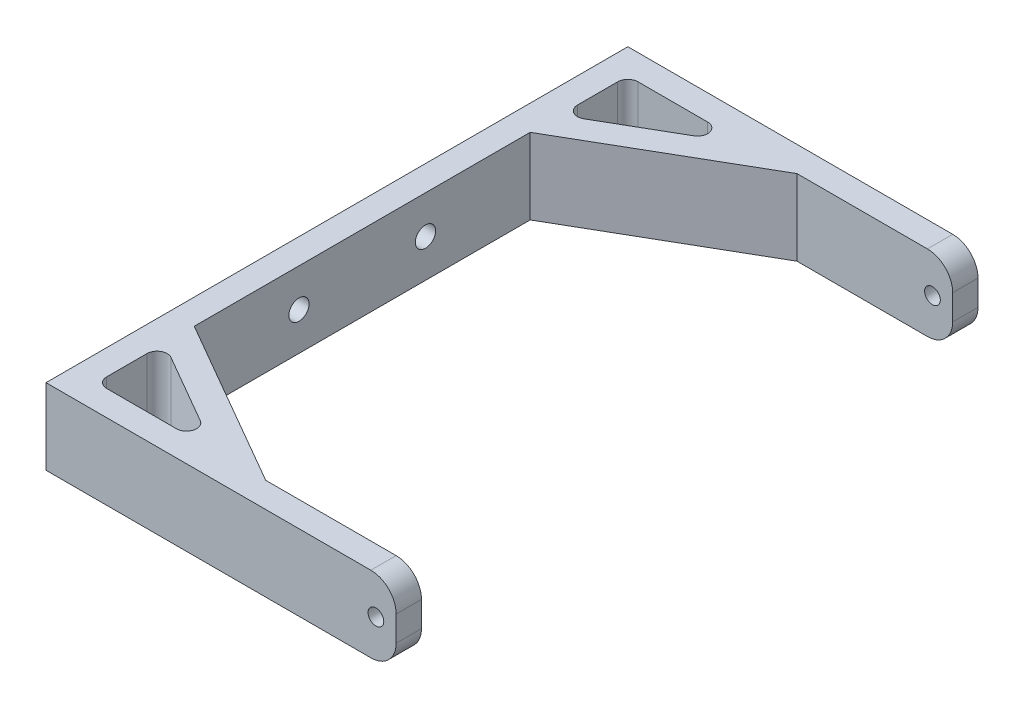
ISO-10303-21;
HEADER;
FILE_DESCRIPTION(('STEP AP214'),'2;1');
FILE_NAME('part.step','',(''),(''),'','','');
FILE_SCHEMA(('AUTOMOTIVE_DESIGN { 1 0 10303 214 1 1 1 1 }'));
ENDSEC;
DATA;
#1=APPLICATION_CONTEXT('core data for automotive mechanical design processes');
#2=APPLICATION_PROTOCOL_DEFINITION('international standard','automotive_design',2000,#1);
#3=PRODUCT_CONTEXT('',#1,'mechanical');
#4=PRODUCT('Part','Part','',(#3));
#5=PRODUCT_RELATED_PRODUCT_CATEGORY('part','',(#4));
#6=PRODUCT_DEFINITION_FORMATION('','',#4);
#7=PRODUCT_DEFINITION_CONTEXT('part definition',#1,'design');
#8=PRODUCT_DEFINITION('design','',#6,#7);
#9=PRODUCT_DEFINITION_SHAPE('','',#8);
#10=(LENGTH_UNIT() NAMED_UNIT(*) SI_UNIT(.MILLI.,.METRE.));
#11=(NAMED_UNIT(*) PLANE_ANGLE_UNIT() SI_UNIT($,.RADIAN.));
#12=(NAMED_UNIT(*) SI_UNIT($,.STERADIAN.) SOLID_ANGLE_UNIT());
#13=UNCERTAINTY_MEASURE_WITH_UNIT(LENGTH_MEASURE(1.E-05),#10,'distance_accuracy_value','');
#14=(GEOMETRIC_REPRESENTATION_CONTEXT(3) GLOBAL_UNCERTAINTY_ASSIGNED_CONTEXT((#13)) GLOBAL_UNIT_ASSIGNED_CONTEXT((#10,
#11,#12)) REPRESENTATION_CONTEXT('',''));
#15=CARTESIAN_POINT('',(0.,0.,0.));
#16=DIRECTION('',(0.,0.,1.));
#17=DIRECTION('',(1.,0.,0.));
#18=AXIS2_PLACEMENT_3D('',#15,#16,#17);
#19=CARTESIAN_POINT('',(0.,15.,0.));
#20=DIRECTION('',(0.,-1.,0.));
#21=DIRECTION('',(0.,0.,-1.));
#22=AXIS2_PLACEMENT_3D('',#19,#20,#21);
#23=PLANE('',#22);
#24=DIRECTION('',(-1.,0.,0.));
#25=VECTOR('',#24,1.);
#26=CARTESIAN_POINT('',(25.7342905835962,15.,-52.5));
#27=LINE('',#26,#25);
#28=CARTESIAN_POINT('',(18.2701889684584,15.,-52.5));
#29=VERTEX_POINT('',#28);
#30=CARTESIAN_POINT('',(4.5,15.,-52.5));
#31=VERTEX_POINT('',#30);
#32=EDGE_CURVE('E527',#29,#31,#27,.T.);
#33=ORIENTED_EDGE('',*,*,#32,.F.);
#34=CARTESIAN_POINT('',(18.2701889684584,15.,-50.5));
#35=DIRECTION('',(0.,-1.,0.));
#36=DIRECTION('',(0.,0.,-1.));
#37=AXIS2_PLACEMENT_3D('',#34,#35,#36);
#38=CIRCLE('',#37,2.);
#39=CARTESIAN_POINT('',(19.2701889684584,15.,-48.7679491924311));
#40=VERTEX_POINT('',#39);
#41=EDGE_CURVE('E283',#29,#40,#38,.T.);
#42=ORIENTED_EDGE('',*,*,#41,.T.);
#43=DIRECTION('',(0.866025403784441,0.,-0.499999999999995));
#44=VECTOR('',#43,1.);
#45=CARTESIAN_POINT('',(2.50000000000001,15.,-39.0856760771309));
#46=LINE('',#45,#44);
#47=CARTESIAN_POINT('',(5.5,15.,-40.8177268846997));
#48=VERTEX_POINT('',#47);
#49=EDGE_CURVE('E368',#48,#40,#46,.T.);
#50=ORIENTED_EDGE('',*,*,#49,.F.);
#51=CARTESIAN_POINT('',(4.5,15.,-42.5497776922686));
#52=DIRECTION('',(0.,-1.,0.));
#53=DIRECTION('',(0.,0.,-1.));
#54=AXIS2_PLACEMENT_3D('',#51,#52,#53);
#55=CIRCLE('',#54,2.);
#56=CARTESIAN_POINT('',(2.5,15.,-42.5497776922686));
#57=VERTEX_POINT('',#56);
#58=EDGE_CURVE('E279',#48,#57,#55,.T.);
#59=ORIENTED_EDGE('',*,*,#58,.T.);
#60=DIRECTION('',(0.,0.,1.));
#61=VECTOR('',#60,1.);
#62=CARTESIAN_POINT('',(2.5,15.,-52.5));
#63=LINE('',#62,#61);
#64=CARTESIAN_POINT('',(2.5,15.,-50.5));
#65=VERTEX_POINT('',#64);
#66=EDGE_CURVE('E530',#65,#57,#63,.T.);
#67=ORIENTED_EDGE('',*,*,#66,.F.);
#68=CARTESIAN_POINT('',(4.5,15.,-50.5));
#69=DIRECTION('',(0.,-1.,0.));
#70=DIRECTION('',(0.,0.,-1.));
#71=AXIS2_PLACEMENT_3D('',#68,#69,#70);
#72=CIRCLE('',#71,2.);
#73=EDGE_CURVE('E287',#65,#31,#72,.T.);
#74=ORIENTED_EDGE('',*,*,#73,.T.);
#75=EDGE_LOOP('',(#33,#42,#50,#59,#67,#74));
#76=FACE_BOUND('',#75,.T.);
#77=DIRECTION('',(1.,0.,0.));
#78=VECTOR('',#77,1.);
#79=CARTESIAN_POINT('',(34.9278302695179,15.,57.5));
#80=LINE('',#79,#78);
#81=CARTESIAN_POINT('',(-2.5,15.,57.5));
#82=VERTEX_POINT('',#81);
#83=CARTESIAN_POINT('',(61.7079178543789,15.,57.5));
#84=VERTEX_POINT('',#83);
#85=EDGE_CURVE('E357',#82,#84,#80,.T.);
#86=ORIENTED_EDGE('',*,*,#85,.T.);
#87=DIRECTION('',(0.,0.,-1.));
#88=VECTOR('',#87,1.);
#89=CARTESIAN_POINT('',(61.7079178543789,15.,0.));
#90=LINE('',#89,#88);
#91=CARTESIAN_POINT('',(61.7079178543789,15.,52.5));
#92=VERTEX_POINT('',#91);
#93=EDGE_CURVE('E320',#84,#92,#90,.T.);
#94=ORIENTED_EDGE('',*,*,#93,.T.);
#95=DIRECTION('',(-1.,0.,0.));
#96=VECTOR('',#95,1.);
#97=CARTESIAN_POINT('',(61.7079178543789,15.,52.5));
#98=LINE('',#97,#96);
#99=CARTESIAN_POINT('',(35.930443006303,15.,52.5));
#100=VERTEX_POINT('',#99);
#101=EDGE_CURVE('E361',#92,#100,#98,.T.);
#102=ORIENTED_EDGE('',*,*,#101,.T.);
#103=DIRECTION('',(-0.866025403784441,0.,-0.499999999999995));
#104=VECTOR('',#103,1.);
#105=CARTESIAN_POINT('',(35.930443006303,15.,52.5));
#106=LINE('',#105,#104);
#107=CARTESIAN_POINT('',(2.5,15.,33.1989247311828));
#108=VERTEX_POINT('',#107);
#109=EDGE_CURVE('E363',#100,#108,#106,.T.);
#110=ORIENTED_EDGE('',*,*,#109,.T.);
#111=DIRECTION('',(0.,0.,-1.));
#112=VECTOR('',#111,1.);
#113=CARTESIAN_POINT('',(2.5,15.,33.1989247311828));
#114=LINE('',#113,#112);
#115=CARTESIAN_POINT('',(2.5,15.,-33.1989247311828));
#116=VERTEX_POINT('',#115);
#117=EDGE_CURVE('E227',#108,#116,#114,.T.);
#118=ORIENTED_EDGE('',*,*,#117,.T.);
#119=DIRECTION('',(0.866025403784441,0.,-0.499999999999995));
#120=VECTOR('',#119,1.);
#121=CARTESIAN_POINT('',(35.930443006303,15.,-52.5));
#122=LINE('',#121,#120);
#123=CARTESIAN_POINT('',(35.930443006303,15.,-52.5));
#124=VERTEX_POINT('',#123);
#125=EDGE_CURVE('E221',#116,#124,#122,.T.);
#126=ORIENTED_EDGE('',*,*,#125,.T.);
#127=DIRECTION('',(1.,0.,0.));
#128=VECTOR('',#127,1.);
#129=CARTESIAN_POINT('',(61.7079178543789,15.,-52.5));
#130=LINE('',#129,#128);
#131=CARTESIAN_POINT('',(61.7079178543789,15.,-52.5));
#132=VERTEX_POINT('',#131);
#133=EDGE_CURVE('E210',#124,#132,#130,.T.);
#134=ORIENTED_EDGE('',*,*,#133,.T.);
#135=DIRECTION('',(0.,0.,-1.));
#136=VECTOR('',#135,1.);
#137=CARTESIAN_POINT('',(61.7079178543789,15.,0.));
#138=LINE('',#137,#136);
#139=CARTESIAN_POINT('',(61.7079178543789,15.,-57.5));
#140=VERTEX_POINT('',#139);
#141=EDGE_CURVE('E318',#132,#140,#138,.T.);
#142=ORIENTED_EDGE('',*,*,#141,.T.);
#143=DIRECTION('',(-1.,0.,0.));
#144=VECTOR('',#143,1.);
#145=CARTESIAN_POINT('',(66.7079178543789,15.,-57.5));
#146=LINE('',#145,#144);
#147=CARTESIAN_POINT('',(-2.5,15.,-57.5));
#148=VERTEX_POINT('',#147);
#149=EDGE_CURVE('E220',#140,#148,#146,.T.);
#150=ORIENTED_EDGE('',*,*,#149,.T.);
#151=DIRECTION('',(0.,0.,1.));
#152=VECTOR('',#151,1.);
#153=CARTESIAN_POINT('',(-2.5,15.,-57.5));
#154=LINE('',#153,#152);
#155=EDGE_CURVE('E355',#148,#82,#154,.T.);
#156=ORIENTED_EDGE('',*,*,#155,.T.);
#157=EDGE_LOOP('',(#86,#94,#102,#110,#118,#126,#134,#142,#150,#156));
#158=FACE_BOUND('',#157,.T.);
#159=DIRECTION('',(1.,0.,0.));
#160=VECTOR('',#159,1.);
#161=CARTESIAN_POINT('',(25.7342905835962,15.,52.5));
#162=LINE('',#161,#160);
#163=CARTESIAN_POINT('',(4.5,15.,52.5));
#164=VERTEX_POINT('',#163);
#165=CARTESIAN_POINT('',(18.2701889684584,15.,52.5));
#166=VERTEX_POINT('',#165);
#167=EDGE_CURVE('E509',#164,#166,#162,.T.);
#168=ORIENTED_EDGE('',*,*,#167,.F.);
#169=CARTESIAN_POINT('',(4.5,15.,50.5));
#170=DIRECTION('',(0.,-1.,0.));
#171=DIRECTION('',(0.,0.,-1.));
#172=AXIS2_PLACEMENT_3D('',#169,#170,#171);
#173=CIRCLE('',#172,2.);
#174=CARTESIAN_POINT('',(2.5,15.,50.5));
#175=VERTEX_POINT('',#174);
#176=EDGE_CURVE('E295',#164,#175,#173,.T.);
#177=ORIENTED_EDGE('',*,*,#176,.T.);
#178=DIRECTION('',(0.,0.,1.));
#179=VECTOR('',#178,1.);
#180=CARTESIAN_POINT('',(2.5,15.,52.5));
#181=LINE('',#180,#179);
#182=CARTESIAN_POINT('',(2.5,15.,42.5497776922686));
#183=VERTEX_POINT('',#182);
#184=EDGE_CURVE('E516',#183,#175,#181,.T.);
#185=ORIENTED_EDGE('',*,*,#184,.F.);
#186=CARTESIAN_POINT('',(4.5,15.,42.5497776922686));
#187=DIRECTION('',(0.,-1.,0.));
#188=DIRECTION('',(0.,0.,-1.));
#189=AXIS2_PLACEMENT_3D('',#186,#187,#188);
#190=CIRCLE('',#189,2.);
#191=CARTESIAN_POINT('',(5.49999999999999,15.,40.8177268846997));
#192=VERTEX_POINT('',#191);
#193=EDGE_CURVE('E299',#183,#192,#190,.T.);
#194=ORIENTED_EDGE('',*,*,#193,.T.);
#195=DIRECTION('',(-0.866025403784441,0.,-0.499999999999995));
#196=VECTOR('',#195,1.);
#197=CARTESIAN_POINT('',(2.5,15.,39.0856760771309));
#198=LINE('',#197,#196);
#199=CARTESIAN_POINT('',(19.2701889684584,15.,48.7679491924311));
#200=VERTEX_POINT('',#199);
#201=EDGE_CURVE('E512',#200,#192,#198,.T.);
#202=ORIENTED_EDGE('',*,*,#201,.F.);
#203=CARTESIAN_POINT('',(18.2701889684584,15.,50.5));
#204=DIRECTION('',(0.,-1.,0.));
#205=DIRECTION('',(0.,0.,-1.));
#206=AXIS2_PLACEMENT_3D('',#203,#204,#205);
#207=CIRCLE('',#206,2.);
#208=EDGE_CURVE('E291',#200,#166,#207,.T.);
#209=ORIENTED_EDGE('',*,*,#208,.T.);
#210=EDGE_LOOP('',(#168,#177,#185,#194,#202,#209));
#211=FACE_BOUND('',#210,.T.);
#212=ADVANCED_FACE('F38',(#76,#158,#211),#23,.F.);
#213=CARTESIAN_POINT('',(0.,0.,0.));
#214=DIRECTION('',(0.,-1.,0.));
#215=DIRECTION('',(0.,0.,-1.));
#216=AXIS2_PLACEMENT_3D('',#213,#214,#215);
#217=PLANE('',#216);
#218=DIRECTION('',(-1.,0.,0.));
#219=VECTOR('',#218,1.);
#220=CARTESIAN_POINT('',(61.7079178543789,0.,52.5));
#221=LINE('',#220,#219);
#222=CARTESIAN_POINT('',(61.7079178543789,0.,52.5));
#223=VERTEX_POINT('',#222);
#224=CARTESIAN_POINT('',(35.930443006303,0.,52.5));
#225=VERTEX_POINT('',#224);
#226=EDGE_CURVE('E374',#223,#225,#221,.T.);
#227=ORIENTED_EDGE('',*,*,#226,.F.);
#228=DIRECTION('',(0.,0.,-1.));
#229=VECTOR('',#228,1.);
#230=CARTESIAN_POINT('',(61.7079178543789,0.,57.5));
#231=LINE('',#230,#229);
#232=CARTESIAN_POINT('',(61.7079178543789,0.,57.5));
#233=VERTEX_POINT('',#232);
#234=EDGE_CURVE('E312',#223,#233,#231,.F.);
#235=ORIENTED_EDGE('',*,*,#234,.T.);
#236=DIRECTION('',(1.,0.,0.));
#237=VECTOR('',#236,1.);
#238=CARTESIAN_POINT('',(66.7079178543789,0.,57.5));
#239=LINE('',#238,#237);
#240=CARTESIAN_POINT('',(-2.5,0.,57.5));
#241=VERTEX_POINT('',#240);
#242=EDGE_CURVE('E371',#241,#233,#239,.T.);
#243=ORIENTED_EDGE('',*,*,#242,.F.);
#244=DIRECTION('',(0.,0.,1.));
#245=VECTOR('',#244,1.);
#246=CARTESIAN_POINT('',(-2.5,0.,57.5));
#247=LINE('',#246,#245);
#248=CARTESIAN_POINT('',(-2.5,0.,-57.5));
#249=VERTEX_POINT('',#248);
#250=EDGE_CURVE('E345',#249,#241,#247,.T.);
#251=ORIENTED_EDGE('',*,*,#250,.F.);
#252=DIRECTION('',(-1.,0.,0.));
#253=VECTOR('',#252,1.);
#254=CARTESIAN_POINT('',(34.9278302695179,0.,-57.5));
#255=LINE('',#254,#253);
#256=CARTESIAN_POINT('',(61.7079178543789,0.,-57.5));
#257=VERTEX_POINT('',#256);
#258=EDGE_CURVE('E335',#257,#249,#255,.T.);
#259=ORIENTED_EDGE('',*,*,#258,.F.);
#260=DIRECTION('',(0.,0.,-1.));
#261=VECTOR('',#260,1.);
#262=CARTESIAN_POINT('',(61.7079178543789,0.,-52.5));
#263=LINE('',#262,#261);
#264=CARTESIAN_POINT('',(61.7079178543789,0.,-52.5));
#265=VERTEX_POINT('',#264);
#266=EDGE_CURVE('E310',#257,#265,#263,.F.);
#267=ORIENTED_EDGE('',*,*,#266,.T.);
#268=DIRECTION('',(1.,0.,0.));
#269=VECTOR('',#268,1.);
#270=CARTESIAN_POINT('',(61.7079178543789,0.,-52.5));
#271=LINE('',#270,#269);
#272=CARTESIAN_POINT('',(35.930443006303,0.,-52.5));
#273=VERTEX_POINT('',#272);
#274=EDGE_CURVE('E347',#273,#265,#271,.T.);
#275=ORIENTED_EDGE('',*,*,#274,.F.);
#276=DIRECTION('',(0.866025403784441,0.,-0.499999999999995));
#277=VECTOR('',#276,1.);
#278=CARTESIAN_POINT('',(35.930443006303,0.,-52.5));
#279=LINE('',#278,#277);
#280=CARTESIAN_POINT('',(2.5,0.,-33.1989247311828));
#281=VERTEX_POINT('',#280);
#282=EDGE_CURVE('E235',#281,#273,#279,.T.);
#283=ORIENTED_EDGE('',*,*,#282,.F.);
#284=DIRECTION('',(0.,0.,-1.));
#285=VECTOR('',#284,1.);
#286=CARTESIAN_POINT('',(2.5,0.,33.1989247311828));
#287=LINE('',#286,#285);
#288=CARTESIAN_POINT('',(2.5,0.,33.1989247311828));
#289=VERTEX_POINT('',#288);
#290=EDGE_CURVE('E231',#289,#281,#287,.T.);
#291=ORIENTED_EDGE('',*,*,#290,.F.);
#292=DIRECTION('',(-0.866025403784441,0.,-0.499999999999995));
#293=VECTOR('',#292,1.);
#294=CARTESIAN_POINT('',(35.930443006303,0.,52.5));
#295=LINE('',#294,#293);
#296=EDGE_CURVE('E376',#225,#289,#295,.T.);
#297=ORIENTED_EDGE('',*,*,#296,.F.);
#298=EDGE_LOOP('',(#227,#235,#243,#251,#259,#267,#275,#283,#291,#297));
#299=FACE_BOUND('',#298,.T.);
#300=DIRECTION('',(0.,0.,1.));
#301=VECTOR('',#300,1.);
#302=CARTESIAN_POINT('',(2.5,0.,-52.5));
#303=LINE('',#302,#301);
#304=CARTESIAN_POINT('',(2.5,0.,-50.5));
#305=VERTEX_POINT('',#304);
#306=CARTESIAN_POINT('',(2.5,0.,-42.5497776922686));
#307=VERTEX_POINT('',#306);
#308=EDGE_CURVE('E538',#305,#307,#303,.T.);
#309=ORIENTED_EDGE('',*,*,#308,.T.);
#310=CARTESIAN_POINT('',(4.5,0.,-42.5497776922686));
#311=DIRECTION('',(0.,-1.,0.));
#312=DIRECTION('',(0.,0.,-1.));
#313=AXIS2_PLACEMENT_3D('',#310,#311,#312);
#314=CIRCLE('',#313,2.);
#315=CARTESIAN_POINT('',(5.5,0.,-40.8177268846997));
#316=VERTEX_POINT('',#315);
#317=EDGE_CURVE('E277',#307,#316,#314,.F.);
#318=ORIENTED_EDGE('',*,*,#317,.T.);
#319=DIRECTION('',(0.866025403784441,0.,-0.499999999999995));
#320=VECTOR('',#319,1.);
#321=CARTESIAN_POINT('',(2.50000000000001,0.,-39.0856760771309));
#322=LINE('',#321,#320);
#323=CARTESIAN_POINT('',(19.2701889684584,0.,-48.7679491924311));
#324=VERTEX_POINT('',#323);
#325=EDGE_CURVE('E531',#316,#324,#322,.T.);
#326=ORIENTED_EDGE('',*,*,#325,.T.);
#327=CARTESIAN_POINT('',(18.2701889684584,0.,-50.5));
#328=DIRECTION('',(0.,-1.,0.));
#329=DIRECTION('',(0.,0.,-1.));
#330=AXIS2_PLACEMENT_3D('',#327,#328,#329);
#331=CIRCLE('',#330,2.);
#332=CARTESIAN_POINT('',(18.2701889684584,0.,-52.5));
#333=VERTEX_POINT('',#332);
#334=EDGE_CURVE('E281',#324,#333,#331,.F.);
#335=ORIENTED_EDGE('',*,*,#334,.T.);
#336=DIRECTION('',(-1.,0.,0.));
#337=VECTOR('',#336,1.);
#338=CARTESIAN_POINT('',(25.7342905835962,0.,-52.5));
#339=LINE('',#338,#337);
#340=CARTESIAN_POINT('',(4.5,0.,-52.5));
#341=VERTEX_POINT('',#340);
#342=EDGE_CURVE('E519',#333,#341,#339,.T.);
#343=ORIENTED_EDGE('',*,*,#342,.T.);
#344=CARTESIAN_POINT('',(4.5,0.,-50.5));
#345=DIRECTION('',(0.,-1.,0.));
#346=DIRECTION('',(0.,0.,-1.));
#347=AXIS2_PLACEMENT_3D('',#344,#345,#346);
#348=CIRCLE('',#347,2.);
#349=EDGE_CURVE('E285',#341,#305,#348,.F.);
#350=ORIENTED_EDGE('',*,*,#349,.T.);
#351=EDGE_LOOP('',(#309,#318,#326,#335,#343,#350));
#352=FACE_BOUND('',#351,.T.);
#353=DIRECTION('',(-0.866025403784441,0.,-0.499999999999995));
#354=VECTOR('',#353,1.);
#355=CARTESIAN_POINT('',(2.5,0.,39.0856760771309));
#356=LINE('',#355,#354);
#357=CARTESIAN_POINT('',(19.2701889684584,0.,48.7679491924311));
#358=VERTEX_POINT('',#357);
#359=CARTESIAN_POINT('',(5.49999999999999,0.,40.8177268846997));
#360=VERTEX_POINT('',#359);
#361=EDGE_CURVE('E522',#358,#360,#356,.T.);
#362=ORIENTED_EDGE('',*,*,#361,.T.);
#363=CARTESIAN_POINT('',(4.5,0.,42.5497776922686));
#364=DIRECTION('',(0.,-1.,0.));
#365=DIRECTION('',(0.,0.,-1.));
#366=AXIS2_PLACEMENT_3D('',#363,#364,#365);
#367=CIRCLE('',#366,2.);
#368=CARTESIAN_POINT('',(2.5,0.,42.5497776922686));
#369=VERTEX_POINT('',#368);
#370=EDGE_CURVE('E297',#360,#369,#367,.F.);
#371=ORIENTED_EDGE('',*,*,#370,.T.);
#372=DIRECTION('',(0.,0.,1.));
#373=VECTOR('',#372,1.);
#374=CARTESIAN_POINT('',(2.5,0.,52.5));
#375=LINE('',#374,#373);
#376=CARTESIAN_POINT('',(2.5,0.,50.5));
#377=VERTEX_POINT('',#376);
#378=EDGE_CURVE('E513',#369,#377,#375,.T.);
#379=ORIENTED_EDGE('',*,*,#378,.T.);
#380=CARTESIAN_POINT('',(4.5,0.,50.5));
#381=DIRECTION('',(0.,-1.,0.));
#382=DIRECTION('',(0.,0.,-1.));
#383=AXIS2_PLACEMENT_3D('',#380,#381,#382);
#384=CIRCLE('',#383,2.);
#385=CARTESIAN_POINT('',(4.5,0.,52.5));
#386=VERTEX_POINT('',#385);
#387=EDGE_CURVE('E293',#377,#386,#384,.F.);
#388=ORIENTED_EDGE('',*,*,#387,.T.);
#389=DIRECTION('',(1.,0.,0.));
#390=VECTOR('',#389,1.);
#391=CARTESIAN_POINT('',(25.7342905835962,0.,52.5));
#392=LINE('',#391,#390);
#393=CARTESIAN_POINT('',(18.2701889684584,0.,52.5));
#394=VERTEX_POINT('',#393);
#395=EDGE_CURVE('E508',#386,#394,#392,.T.);
#396=ORIENTED_EDGE('',*,*,#395,.T.);
#397=CARTESIAN_POINT('',(18.2701889684584,0.,50.5));
#398=DIRECTION('',(0.,-1.,0.));
#399=DIRECTION('',(0.,0.,-1.));
#400=AXIS2_PLACEMENT_3D('',#397,#398,#399);
#401=CIRCLE('',#400,2.);
#402=EDGE_CURVE('E289',#394,#358,#401,.F.);
#403=ORIENTED_EDGE('',*,*,#402,.T.);
#404=EDGE_LOOP('',(#362,#371,#379,#388,#396,#403));
#405=FACE_BOUND('',#404,.T.);
#406=ADVANCED_FACE('F342',(#299,#352,#405),#217,.T.);
#407=CARTESIAN_POINT('',(35.930443006303,15.,-52.5));
#408=DIRECTION('',(-0.499999999999995,0.,-0.866025403784441));
#409=DIRECTION('',(-0.866025403784442,0.,0.499999999999995));
#410=AXIS2_PLACEMENT_3D('',#407,#408,#409);
#411=PLANE('',#410);
#412=ORIENTED_EDGE('',*,*,#282,.T.);
#413=DIRECTION('',(0.,-1.,0.));
#414=VECTOR('',#413,1.);
#415=CARTESIAN_POINT('',(35.930443006303,15.,-52.5));
#416=LINE('',#415,#414);
#417=EDGE_CURVE('E214',#124,#273,#416,.T.);
#418=ORIENTED_EDGE('',*,*,#417,.F.);
#419=ORIENTED_EDGE('',*,*,#125,.F.);
#420=DIRECTION('',(0.,-1.,0.));
#421=VECTOR('',#420,1.);
#422=CARTESIAN_POINT('',(2.5,15.,-33.1989247311828));
#423=LINE('',#422,#421);
#424=EDGE_CURVE('E366',#116,#281,#423,.T.);
#425=ORIENTED_EDGE('',*,*,#424,.T.);
#426=EDGE_LOOP('',(#412,#418,#419,#425));
#427=FACE_BOUND('',#426,.T.);
#428=ADVANCED_FACE('F233',(#427),#411,.F.);
#429=CARTESIAN_POINT('',(61.7079178543789,15.,-52.5));
#430=DIRECTION('',(0.,0.,-1.));
#431=DIRECTION('',(-1.,0.,0.));
#432=AXIS2_PLACEMENT_3D('',#429,#430,#431);
#433=PLANE('',#432);
#434=CARTESIAN_POINT('',(62.7079178543789,7.5,-52.5));
#435=DIRECTION('',(0.,0.,-1.));
#436=DIRECTION('',(-1.,0.,0.));
#437=AXIS2_PLACEMENT_3D('',#434,#435,#436);
#438=CIRCLE('',#437,1.54999999999999);
#439=CARTESIAN_POINT('',(61.1579178543789,7.5,-52.5));
#440=VERTEX_POINT('',#439);
#441=EDGE_CURVE('E505',#440,#440,#438,.T.);
#442=ORIENTED_EDGE('',*,*,#441,.T.);
#443=EDGE_LOOP('',(#442));
#444=FACE_BOUND('',#443,.T.);
#445=ORIENTED_EDGE('',*,*,#274,.T.);
#446=CARTESIAN_POINT('',(61.7079178543789,5.,-52.5));
#447=DIRECTION('',(0.,0.,-1.));
#448=DIRECTION('',(-1.,0.,0.));
#449=AXIS2_PLACEMENT_3D('',#446,#447,#448);
#450=CIRCLE('',#449,5.);
#451=CARTESIAN_POINT('',(66.7079178543789,5.,-52.5));
#452=VERTEX_POINT('',#451);
#453=EDGE_CURVE('E11',#265,#452,#450,.F.);
#454=ORIENTED_EDGE('',*,*,#453,.T.);
#455=DIRECTION('',(0.,-1.,0.));
#456=VECTOR('',#455,1.);
#457=CARTESIAN_POINT('',(66.7079178543789,15.,-52.5));
#458=LINE('',#457,#456);
#459=CARTESIAN_POINT('',(66.7079178543789,10.,-52.5));
#460=VERTEX_POINT('',#459);
#461=EDGE_CURVE('E237',#460,#452,#458,.T.);
#462=ORIENTED_EDGE('',*,*,#461,.F.);
#463=CARTESIAN_POINT('',(61.7079178543789,10.,-52.5));
#464=DIRECTION('',(0.,0.,-1.));
#465=DIRECTION('',(-1.,0.,0.));
#466=AXIS2_PLACEMENT_3D('',#463,#464,#465);
#467=CIRCLE('',#466,5.);
#468=EDGE_CURVE('E46',#460,#132,#467,.F.);
#469=ORIENTED_EDGE('',*,*,#468,.T.);
#470=ORIENTED_EDGE('',*,*,#133,.F.);
#471=ORIENTED_EDGE('',*,*,#417,.T.);
#472=EDGE_LOOP('',(#445,#454,#462,#469,#470,#471));
#473=FACE_BOUND('',#472,.T.);
#474=ADVANCED_FACE('F212',(#444,#473),#433,.F.);
#475=CARTESIAN_POINT('',(66.7079178543789,15.,-52.5));
#476=DIRECTION('',(-1.,0.,0.));
#477=DIRECTION('',(0.,0.,1.));
#478=AXIS2_PLACEMENT_3D('',#475,#476,#477);
#479=PLANE('',#478);
#480=ORIENTED_EDGE('',*,*,#461,.T.);
#481=DIRECTION('',(0.,0.,-1.));
#482=VECTOR('',#481,1.);
#483=CARTESIAN_POINT('',(66.7079178543789,5.,-57.5));
#484=LINE('',#483,#482);
#485=CARTESIAN_POINT('',(66.7079178543789,5.,-57.5));
#486=VERTEX_POINT('',#485);
#487=EDGE_CURVE('E324',#452,#486,#484,.T.);
#488=ORIENTED_EDGE('',*,*,#487,.T.);
#489=DIRECTION('',(0.,-1.,0.));
#490=VECTOR('',#489,1.);
#491=CARTESIAN_POINT('',(66.7079178543789,15.,-57.5));
#492=LINE('',#491,#490);
#493=CARTESIAN_POINT('',(66.7079178543789,10.,-57.5));
#494=VERTEX_POINT('',#493);
#495=EDGE_CURVE('E241',#494,#486,#492,.T.);
#496=ORIENTED_EDGE('',*,*,#495,.F.);
#497=DIRECTION('',(0.,0.,-1.));
#498=VECTOR('',#497,1.);
#499=CARTESIAN_POINT('',(66.7079178543789,10.,-52.5));
#500=LINE('',#499,#498);
#501=EDGE_CURVE('E58',#494,#460,#500,.F.);
#502=ORIENTED_EDGE('',*,*,#501,.T.);
#503=EDGE_LOOP('',(#480,#488,#496,#502));
#504=FACE_BOUND('',#503,.T.);
#505=ADVANCED_FACE('F350',(#504),#479,.F.);
#506=CARTESIAN_POINT('',(34.9278302695179,15.,-57.5));
#507=DIRECTION('',(0.,0.,1.));
#508=DIRECTION('',(1.,0.,0.));
#509=AXIS2_PLACEMENT_3D('',#506,#507,#508);
#510=PLANE('',#509);
#511=CARTESIAN_POINT('',(62.7079178543789,7.5,-57.5));
#512=DIRECTION('',(0.,0.,1.));
#513=DIRECTION('',(1.,0.,0.));
#514=AXIS2_PLACEMENT_3D('',#511,#512,#513);
#515=CIRCLE('',#514,1.54999999999999);
#516=CARTESIAN_POINT('',(64.2579178543789,7.5,-57.5));
#517=VERTEX_POINT('',#516);
#518=EDGE_CURVE('E248',#517,#517,#515,.T.);
#519=ORIENTED_EDGE('',*,*,#518,.T.);
#520=EDGE_LOOP('',(#519));
#521=FACE_BOUND('',#520,.T.);
#522=ORIENTED_EDGE('',*,*,#495,.T.);
#523=CARTESIAN_POINT('',(61.7079178543789,5.,-57.5));
#524=DIRECTION('',(0.,0.,1.));
#525=DIRECTION('',(1.,0.,0.));
#526=AXIS2_PLACEMENT_3D('',#523,#524,#525);
#527=CIRCLE('',#526,5.);
#528=EDGE_CURVE('E329',#486,#257,#527,.F.);
#529=ORIENTED_EDGE('',*,*,#528,.T.);
#530=ORIENTED_EDGE('',*,*,#258,.T.);
#531=DIRECTION('',(0.,-1.,0.));
#532=VECTOR('',#531,1.);
#533=CARTESIAN_POINT('',(-2.5,15.,-57.5));
#534=LINE('',#533,#532);
#535=EDGE_CURVE('E353',#148,#249,#534,.T.);
#536=ORIENTED_EDGE('',*,*,#535,.F.);
#537=ORIENTED_EDGE('',*,*,#149,.F.);
#538=CARTESIAN_POINT('',(61.7079178543789,10.,-57.5));
#539=DIRECTION('',(0.,0.,1.));
#540=DIRECTION('',(1.,0.,0.));
#541=AXIS2_PLACEMENT_3D('',#538,#539,#540);
#542=CIRCLE('',#541,5.);
#543=EDGE_CURVE('E327',#140,#494,#542,.F.);
#544=ORIENTED_EDGE('',*,*,#543,.T.);
#545=EDGE_LOOP('',(#522,#529,#530,#536,#537,#544));
#546=FACE_BOUND('',#545,.T.);
#547=ADVANCED_FACE('F333',(#521,#546),#510,.F.);
#548=CARTESIAN_POINT('',(-2.5,15.,57.5));
#549=DIRECTION('',(1.,0.,0.));
#550=DIRECTION('',(0.,0.,-1.));
#551=AXIS2_PLACEMENT_3D('',#548,#549,#550);
#552=PLANE('',#551);
#553=CARTESIAN_POINT('',(-2.5,7.5,12.5));
#554=DIRECTION('',(1.,0.,0.));
#555=DIRECTION('',(0.,0.,-1.));
#556=AXIS2_PLACEMENT_3D('',#553,#554,#555);
#557=CIRCLE('',#556,2.);
#558=CARTESIAN_POINT('',(-2.5,7.5,10.5));
#559=VERTEX_POINT('',#558);
#560=EDGE_CURVE('E489',#559,#559,#557,.T.);
#561=ORIENTED_EDGE('',*,*,#560,.T.);
#562=EDGE_LOOP('',(#561));
#563=FACE_BOUND('',#562,.T.);
#564=CARTESIAN_POINT('',(-2.5,7.5,-12.5));
#565=DIRECTION('',(1.,0.,0.));
#566=DIRECTION('',(0.,0.,-1.));
#567=AXIS2_PLACEMENT_3D('',#564,#565,#566);
#568=CIRCLE('',#567,2.);
#569=CARTESIAN_POINT('',(-2.5,7.5,-14.5));
#570=VERTEX_POINT('',#569);
#571=EDGE_CURVE('E492',#570,#570,#568,.T.);
#572=ORIENTED_EDGE('',*,*,#571,.T.);
#573=EDGE_LOOP('',(#572));
#574=FACE_BOUND('',#573,.T.);
#575=ORIENTED_EDGE('',*,*,#250,.T.);
#576=DIRECTION('',(0.,-1.,0.));
#577=VECTOR('',#576,1.);
#578=CARTESIAN_POINT('',(-2.5,15.,57.5));
#579=LINE('',#578,#577);
#580=EDGE_CURVE('E392',#82,#241,#579,.T.);
#581=ORIENTED_EDGE('',*,*,#580,.F.);
#582=ORIENTED_EDGE('',*,*,#155,.F.);
#583=ORIENTED_EDGE('',*,*,#535,.T.);
#584=EDGE_LOOP('',(#575,#581,#582,#583));
#585=FACE_BOUND('',#584,.T.);
#586=ADVANCED_FACE('F396',(#563,#574,#585),#552,.F.);
#587=CARTESIAN_POINT('',(66.7079178543789,15.,57.5));
#588=DIRECTION('',(0.,0.,-1.));
#589=DIRECTION('',(-1.,0.,0.));
#590=AXIS2_PLACEMENT_3D('',#587,#588,#589);
#591=PLANE('',#590);
#592=CARTESIAN_POINT('',(62.7079178543789,7.5,57.5));
#593=DIRECTION('',(0.,0.,-1.));
#594=DIRECTION('',(-1.,0.,0.));
#595=AXIS2_PLACEMENT_3D('',#592,#593,#594);
#596=CIRCLE('',#595,1.54999999999999);
#597=CARTESIAN_POINT('',(61.1579178543789,7.5,57.5));
#598=VERTEX_POINT('',#597);
#599=EDGE_CURVE('E247',#598,#598,#596,.T.);
#600=ORIENTED_EDGE('',*,*,#599,.T.);
#601=EDGE_LOOP('',(#600));
#602=FACE_BOUND('',#601,.T.);
#603=ORIENTED_EDGE('',*,*,#242,.T.);
#604=CARTESIAN_POINT('',(61.7079178543789,5.,57.5));
#605=DIRECTION('',(0.,0.,-1.));
#606=DIRECTION('',(-1.,0.,0.));
#607=AXIS2_PLACEMENT_3D('',#604,#605,#606);
#608=CIRCLE('',#607,5.);
#609=CARTESIAN_POINT('',(66.7079178543789,5.,57.5));
#610=VERTEX_POINT('',#609);
#611=EDGE_CURVE('E316',#233,#610,#608,.F.);
#612=ORIENTED_EDGE('',*,*,#611,.T.);
#613=DIRECTION('',(0.,-1.,0.));
#614=VECTOR('',#613,1.);
#615=CARTESIAN_POINT('',(66.7079178543789,15.,57.5));
#616=LINE('',#615,#614);
#617=CARTESIAN_POINT('',(66.7079178543789,10.,57.5));
#618=VERTEX_POINT('',#617);
#619=EDGE_CURVE('E389',#618,#610,#616,.T.);
#620=ORIENTED_EDGE('',*,*,#619,.F.);
#621=CARTESIAN_POINT('',(61.7079178543789,10.,57.5));
#622=DIRECTION('',(0.,0.,-1.));
#623=DIRECTION('',(-1.,0.,0.));
#624=AXIS2_PLACEMENT_3D('',#621,#622,#623);
#625=CIRCLE('',#624,5.);
#626=EDGE_CURVE('E314',#618,#84,#625,.F.);
#627=ORIENTED_EDGE('',*,*,#626,.T.);
#628=ORIENTED_EDGE('',*,*,#85,.F.);
#629=ORIENTED_EDGE('',*,*,#580,.T.);
#630=EDGE_LOOP('',(#603,#612,#620,#627,#628,#629));
#631=FACE_BOUND('',#630,.T.);
#632=ADVANCED_FACE('F718',(#602,#631),#591,.F.);
#633=CARTESIAN_POINT('',(66.7079178543789,15.,52.5));
#634=DIRECTION('',(-1.,0.,0.));
#635=DIRECTION('',(0.,0.,1.));
#636=AXIS2_PLACEMENT_3D('',#633,#634,#635);
#637=PLANE('',#636);
#638=ORIENTED_EDGE('',*,*,#619,.T.);
#639=DIRECTION('',(0.,0.,-1.));
#640=VECTOR('',#639,1.);
#641=CARTESIAN_POINT('',(66.7079178543789,5.,52.5));
#642=LINE('',#641,#640);
#643=CARTESIAN_POINT('',(66.7079178543789,5.,52.5));
#644=VERTEX_POINT('',#643);
#645=EDGE_CURVE('E303',#610,#644,#642,.T.);
#646=ORIENTED_EDGE('',*,*,#645,.T.);
#647=DIRECTION('',(0.,-1.,0.));
#648=VECTOR('',#647,1.);
#649=CARTESIAN_POINT('',(66.7079178543789,15.,52.5));
#650=LINE('',#649,#648);
#651=CARTESIAN_POINT('',(66.7079178543789,10.,52.5));
#652=VERTEX_POINT('',#651);
#653=EDGE_CURVE('E386',#652,#644,#650,.T.);
#654=ORIENTED_EDGE('',*,*,#653,.F.);
#655=DIRECTION('',(0.,0.,-1.));
#656=VECTOR('',#655,1.);
#657=CARTESIAN_POINT('',(66.7079178543789,10.,52.5));
#658=LINE('',#657,#656);
#659=EDGE_CURVE('E301',#652,#618,#658,.F.);
#660=ORIENTED_EDGE('',*,*,#659,.T.);
#661=EDGE_LOOP('',(#638,#646,#654,#660));
#662=FACE_BOUND('',#661,.T.);
#663=ADVANCED_FACE('F411',(#662),#637,.F.);
#664=CARTESIAN_POINT('',(61.7079178543789,15.,52.5));
#665=DIRECTION('',(0.,0.,1.));
#666=DIRECTION('',(1.,0.,0.));
#667=AXIS2_PLACEMENT_3D('',#664,#665,#666);
#668=PLANE('',#667);
#669=CARTESIAN_POINT('',(62.7079178543789,7.5,52.5));
#670=DIRECTION('',(0.,0.,1.));
#671=DIRECTION('',(1.,0.,0.));
#672=AXIS2_PLACEMENT_3D('',#669,#670,#671);
#673=CIRCLE('',#672,1.54999999999999);
#674=CARTESIAN_POINT('',(64.2579178543789,7.5,52.5));
#675=VERTEX_POINT('',#674);
#676=EDGE_CURVE('E245',#675,#675,#673,.T.);
#677=ORIENTED_EDGE('',*,*,#676,.T.);
#678=EDGE_LOOP('',(#677));
#679=FACE_BOUND('',#678,.T.);
#680=ORIENTED_EDGE('',*,*,#653,.T.);
#681=CARTESIAN_POINT('',(61.7079178543789,5.,52.5));
#682=DIRECTION('',(0.,0.,1.));
#683=DIRECTION('',(1.,0.,0.));
#684=AXIS2_PLACEMENT_3D('',#681,#682,#683);
#685=CIRCLE('',#684,5.);
#686=EDGE_CURVE('E308',#644,#223,#685,.F.);
#687=ORIENTED_EDGE('',*,*,#686,.T.);
#688=ORIENTED_EDGE('',*,*,#226,.T.);
#689=DIRECTION('',(0.,-1.,0.));
#690=VECTOR('',#689,1.);
#691=CARTESIAN_POINT('',(35.930443006303,15.,52.5));
#692=LINE('',#691,#690);
#693=EDGE_CURVE('E383',#100,#225,#692,.T.);
#694=ORIENTED_EDGE('',*,*,#693,.F.);
#695=ORIENTED_EDGE('',*,*,#101,.F.);
#696=CARTESIAN_POINT('',(61.7079178543789,10.,52.5));
#697=DIRECTION('',(0.,0.,1.));
#698=DIRECTION('',(1.,0.,0.));
#699=AXIS2_PLACEMENT_3D('',#696,#697,#698);
#700=CIRCLE('',#699,5.);
#701=EDGE_CURVE('E306',#92,#652,#700,.F.);
#702=ORIENTED_EDGE('',*,*,#701,.T.);
#703=EDGE_LOOP('',(#680,#687,#688,#694,#695,#702));
#704=FACE_BOUND('',#703,.T.);
#705=ADVANCED_FACE('F408',(#679,#704),#668,.F.);
#706=CARTESIAN_POINT('',(35.930443006303,15.,52.5));
#707=DIRECTION('',(-0.499999999999995,0.,0.866025403784441));
#708=DIRECTION('',(0.866025403784441,0.,0.499999999999995));
#709=AXIS2_PLACEMENT_3D('',#706,#707,#708);
#710=PLANE('',#709);
#711=ORIENTED_EDGE('',*,*,#296,.T.);
#712=DIRECTION('',(0.,-1.,0.));
#713=VECTOR('',#712,1.);
#714=CARTESIAN_POINT('',(2.5,15.,33.1989247311828));
#715=LINE('',#714,#713);
#716=EDGE_CURVE('E380',#108,#289,#715,.T.);
#717=ORIENTED_EDGE('',*,*,#716,.F.);
#718=ORIENTED_EDGE('',*,*,#109,.F.);
#719=ORIENTED_EDGE('',*,*,#693,.T.);
#720=EDGE_LOOP('',(#711,#717,#718,#719));
#721=FACE_BOUND('',#720,.T.);
#722=ADVANCED_FACE('F422',(#721),#710,.F.);
#723=CARTESIAN_POINT('',(2.5,15.,33.1989247311828));
#724=DIRECTION('',(-1.,0.,0.));
#725=DIRECTION('',(0.,0.,1.));
#726=AXIS2_PLACEMENT_3D('',#723,#724,#725);
#727=PLANE('',#726);
#728=CARTESIAN_POINT('',(2.5,7.5,12.5));
#729=DIRECTION('',(1.,0.,0.));
#730=DIRECTION('',(0.,0.,-1.));
#731=AXIS2_PLACEMENT_3D('',#728,#729,#730);
#732=CIRCLE('',#731,2.);
#733=CARTESIAN_POINT('',(2.5,7.5,10.5));
#734=VERTEX_POINT('',#733);
#735=EDGE_CURVE('E491',#734,#734,#732,.T.);
#736=ORIENTED_EDGE('',*,*,#735,.F.);
#737=EDGE_LOOP('',(#736));
#738=FACE_BOUND('',#737,.T.);
#739=CARTESIAN_POINT('',(2.5,7.5,-12.5));
#740=DIRECTION('',(1.,0.,0.));
#741=DIRECTION('',(0.,0.,-1.));
#742=AXIS2_PLACEMENT_3D('',#739,#740,#741);
#743=CIRCLE('',#742,2.);
#744=CARTESIAN_POINT('',(2.5,7.5,-14.5));
#745=VERTEX_POINT('',#744);
#746=EDGE_CURVE('E496',#745,#745,#743,.T.);
#747=ORIENTED_EDGE('',*,*,#746,.F.);
#748=EDGE_LOOP('',(#747));
#749=FACE_BOUND('',#748,.T.);
#750=ORIENTED_EDGE('',*,*,#290,.T.);
#751=ORIENTED_EDGE('',*,*,#424,.F.);
#752=ORIENTED_EDGE('',*,*,#117,.F.);
#753=ORIENTED_EDGE('',*,*,#716,.T.);
#754=EDGE_LOOP('',(#750,#751,#752,#753));
#755=FACE_BOUND('',#754,.T.);
#756=ADVANCED_FACE('F425',(#738,#749,#755),#727,.F.);
#757=CARTESIAN_POINT('',(25.7342905835962,15.,-52.5));
#758=DIRECTION('',(0.,0.,1.));
#759=DIRECTION('',(1.,0.,0.));
#760=AXIS2_PLACEMENT_3D('',#757,#758,#759);
#761=PLANE('',#760);
#762=ORIENTED_EDGE('',*,*,#342,.F.);
#763=DIRECTION('',(0.,-1.,0.));
#764=VECTOR('',#763,1.);
#765=CARTESIAN_POINT('',(18.2701889684584,15.,-52.5));
#766=LINE('',#765,#764);
#767=EDGE_CURVE('E260',#333,#29,#766,.F.);
#768=ORIENTED_EDGE('',*,*,#767,.T.);
#769=ORIENTED_EDGE('',*,*,#32,.T.);
#770=DIRECTION('',(0.,-1.,0.));
#771=VECTOR('',#770,1.);
#772=CARTESIAN_POINT('',(4.5,0.,-52.5));
#773=LINE('',#772,#771);
#774=EDGE_CURVE('E257',#31,#341,#773,.T.);
#775=ORIENTED_EDGE('',*,*,#774,.T.);
#776=EDGE_LOOP('',(#762,#768,#769,#775));
#777=FACE_BOUND('',#776,.T.);
#778=ADVANCED_FACE('F427',(#777),#761,.T.);
#779=CARTESIAN_POINT('',(2.5,15.,-52.5));
#780=DIRECTION('',(1.,0.,0.));
#781=DIRECTION('',(0.,0.,-1.));
#782=AXIS2_PLACEMENT_3D('',#779,#780,#781);
#783=PLANE('',#782);
#784=ORIENTED_EDGE('',*,*,#66,.T.);
#785=DIRECTION('',(0.,-1.,0.));
#786=VECTOR('',#785,1.);
#787=CARTESIAN_POINT('',(2.5,0.,-42.5497776922686));
#788=LINE('',#787,#786);
#789=EDGE_CURVE('E239',#57,#307,#788,.T.);
#790=ORIENTED_EDGE('',*,*,#789,.T.);
#791=ORIENTED_EDGE('',*,*,#308,.F.);
#792=DIRECTION('',(0.,-1.,0.));
#793=VECTOR('',#792,1.);
#794=CARTESIAN_POINT('',(2.5,15.,-50.5));
#795=LINE('',#794,#793);
#796=EDGE_CURVE('E236',#305,#65,#795,.F.);
#797=ORIENTED_EDGE('',*,*,#796,.T.);
#798=EDGE_LOOP('',(#784,#790,#791,#797));
#799=FACE_BOUND('',#798,.T.);
#800=ADVANCED_FACE('F435',(#799),#783,.T.);
#801=CARTESIAN_POINT('',(2.50000000000001,15.,-39.0856760771309));
#802=DIRECTION('',(-0.499999999999995,0.,-0.866025403784441));
#803=DIRECTION('',(-0.866025403784441,0.,0.499999999999995));
#804=AXIS2_PLACEMENT_3D('',#801,#802,#803);
#805=PLANE('',#804);
#806=ORIENTED_EDGE('',*,*,#325,.F.);
#807=DIRECTION('',(0.,-1.,0.));
#808=VECTOR('',#807,1.);
#809=CARTESIAN_POINT('',(5.5,15.,-40.8177268846997));
#810=LINE('',#809,#808);
#811=EDGE_CURVE('E255',#316,#48,#810,.F.);
#812=ORIENTED_EDGE('',*,*,#811,.T.);
#813=ORIENTED_EDGE('',*,*,#49,.T.);
#814=DIRECTION('',(0.,-1.,0.));
#815=VECTOR('',#814,1.);
#816=CARTESIAN_POINT('',(19.2701889684584,0.,-48.7679491924311));
#817=LINE('',#816,#815);
#818=EDGE_CURVE('E252',#40,#324,#817,.T.);
#819=ORIENTED_EDGE('',*,*,#818,.T.);
#820=EDGE_LOOP('',(#806,#812,#813,#819));
#821=FACE_BOUND('',#820,.T.);
#822=ADVANCED_FACE('F454',(#821),#805,.T.);
#823=CARTESIAN_POINT('',(25.7342905835962,15.,52.5));
#824=DIRECTION('',(0.,0.,-1.));
#825=DIRECTION('',(-1.,0.,0.));
#826=AXIS2_PLACEMENT_3D('',#823,#824,#825);
#827=PLANE('',#826);
#828=ORIENTED_EDGE('',*,*,#167,.T.);
#829=DIRECTION('',(0.,-1.,0.));
#830=VECTOR('',#829,1.);
#831=CARTESIAN_POINT('',(18.2701889684584,0.,52.5));
#832=LINE('',#831,#830);
#833=EDGE_CURVE('E264',#166,#394,#832,.T.);
#834=ORIENTED_EDGE('',*,*,#833,.T.);
#835=ORIENTED_EDGE('',*,*,#395,.F.);
#836=DIRECTION('',(0.,-1.,0.));
#837=VECTOR('',#836,1.);
#838=CARTESIAN_POINT('',(4.5,15.,52.5));
#839=LINE('',#838,#837);
#840=EDGE_CURVE('E262',#386,#164,#839,.F.);
#841=ORIENTED_EDGE('',*,*,#840,.T.);
#842=EDGE_LOOP('',(#828,#834,#835,#841));
#843=FACE_BOUND('',#842,.T.);
#844=ADVANCED_FACE('F458',(#843),#827,.T.);
#845=CARTESIAN_POINT('',(2.5,15.,39.0856760771309));
#846=DIRECTION('',(-0.499999999999995,0.,0.866025403784441));
#847=DIRECTION('',(0.866025403784441,0.,0.499999999999995));
#848=AXIS2_PLACEMENT_3D('',#845,#846,#847);
#849=PLANE('',#848);
#850=ORIENTED_EDGE('',*,*,#361,.F.);
#851=DIRECTION('',(0.,-1.,0.));
#852=VECTOR('',#851,1.);
#853=CARTESIAN_POINT('',(19.2701889684584,15.,48.7679491924311));
#854=LINE('',#853,#852);
#855=EDGE_CURVE('E270',#358,#200,#854,.F.);
#856=ORIENTED_EDGE('',*,*,#855,.T.);
#857=ORIENTED_EDGE('',*,*,#201,.T.);
#858=DIRECTION('',(0.,-1.,0.));
#859=VECTOR('',#858,1.);
#860=CARTESIAN_POINT('',(5.49999999999999,0.,40.8177268846997));
#861=LINE('',#860,#859);
#862=EDGE_CURVE('E267',#192,#360,#861,.T.);
#863=ORIENTED_EDGE('',*,*,#862,.T.);
#864=EDGE_LOOP('',(#850,#856,#857,#863));
#865=FACE_BOUND('',#864,.T.);
#866=ADVANCED_FACE('F462',(#865),#849,.T.);
#867=CARTESIAN_POINT('',(2.5,15.,52.5));
#868=DIRECTION('',(1.,0.,0.));
#869=DIRECTION('',(0.,0.,-1.));
#870=AXIS2_PLACEMENT_3D('',#867,#868,#869);
#871=PLANE('',#870);
#872=ORIENTED_EDGE('',*,*,#184,.T.);
#873=DIRECTION('',(0.,-1.,0.));
#874=VECTOR('',#873,1.);
#875=CARTESIAN_POINT('',(2.5,0.,50.5));
#876=LINE('',#875,#874);
#877=EDGE_CURVE('E274',#175,#377,#876,.T.);
#878=ORIENTED_EDGE('',*,*,#877,.T.);
#879=ORIENTED_EDGE('',*,*,#378,.F.);
#880=DIRECTION('',(0.,-1.,0.));
#881=VECTOR('',#880,1.);
#882=CARTESIAN_POINT('',(2.5,15.,42.5497776922686));
#883=LINE('',#882,#881);
#884=EDGE_CURVE('E272',#369,#183,#883,.F.);
#885=ORIENTED_EDGE('',*,*,#884,.T.);
#886=EDGE_LOOP('',(#872,#878,#879,#885));
#887=FACE_BOUND('',#886,.T.);
#888=ADVANCED_FACE('F466',(#887),#871,.T.);
#889=CARTESIAN_POINT('',(62.7079178543789,7.5,-57.5));
#890=DIRECTION('',(0.,0.,1.));
#891=DIRECTION('',(1.,0.,0.));
#892=AXIS2_PLACEMENT_3D('',#889,#890,#891);
#893=CYLINDRICAL_SURFACE('',#892,1.54999999999999);
#894=ORIENTED_EDGE('',*,*,#676,.F.);
#895=EDGE_LOOP('',(#894));
#896=FACE_BOUND('',#895,.T.);
#897=ORIENTED_EDGE('',*,*,#599,.F.);
#898=EDGE_LOOP('',(#897));
#899=FACE_BOUND('',#898,.T.);
#900=ADVANCED_FACE('F470',(#896,#899),#893,.F.);
#901=ORIENTED_EDGE('',*,*,#518,.F.);
#902=EDGE_LOOP('',(#901));
#903=FACE_BOUND('',#902,.T.);
#904=ORIENTED_EDGE('',*,*,#441,.F.);
#905=EDGE_LOOP('',(#904));
#906=FACE_BOUND('',#905,.T.);
#907=ADVANCED_FACE('F472',(#903,#906),#893,.F.);
#908=CARTESIAN_POINT('',(4.5,15.,-42.5497776922686));
#909=DIRECTION('',(0.,1.,0.));
#910=DIRECTION('',(0.,0.,1.));
#911=AXIS2_PLACEMENT_3D('',#908,#909,#910);
#912=CYLINDRICAL_SURFACE('',#911,2.);
#913=ORIENTED_EDGE('',*,*,#58,.F.);
#914=ORIENTED_EDGE('',*,*,#811,.F.);
#915=ORIENTED_EDGE('',*,*,#317,.F.);
#916=ORIENTED_EDGE('',*,*,#789,.F.);
#917=EDGE_LOOP('',(#913,#914,#915,#916));
#918=FACE_BOUND('',#917,.T.);
#919=ADVANCED_FACE('F475',(#918),#912,.F.);
#920=CARTESIAN_POINT('',(18.2701889684584,15.,-50.5));
#921=DIRECTION('',(0.,1.,0.));
#922=DIRECTION('',(0.,0.,1.));
#923=AXIS2_PLACEMENT_3D('',#920,#921,#922);
#924=CYLINDRICAL_SURFACE('',#923,2.);
#925=ORIENTED_EDGE('',*,*,#41,.F.);
#926=ORIENTED_EDGE('',*,*,#767,.F.);
#927=ORIENTED_EDGE('',*,*,#334,.F.);
#928=ORIENTED_EDGE('',*,*,#818,.F.);
#929=EDGE_LOOP('',(#925,#926,#927,#928));
#930=FACE_BOUND('',#929,.T.);
#931=ADVANCED_FACE('F561',(#930),#924,.F.);
#932=CARTESIAN_POINT('',(4.5,15.,-50.5));
#933=DIRECTION('',(0.,1.,0.));
#934=DIRECTION('',(0.,0.,1.));
#935=AXIS2_PLACEMENT_3D('',#932,#933,#934);
#936=CYLINDRICAL_SURFACE('',#935,2.);
#937=ORIENTED_EDGE('',*,*,#73,.F.);
#938=ORIENTED_EDGE('',*,*,#796,.F.);
#939=ORIENTED_EDGE('',*,*,#349,.F.);
#940=ORIENTED_EDGE('',*,*,#774,.F.);
#941=EDGE_LOOP('',(#937,#938,#939,#940));
#942=FACE_BOUND('',#941,.T.);
#943=ADVANCED_FACE('F556',(#942),#936,.F.);
#944=CARTESIAN_POINT('',(18.2701889684584,15.,50.5));
#945=DIRECTION('',(0.,1.,0.));
#946=DIRECTION('',(0.,0.,1.));
#947=AXIS2_PLACEMENT_3D('',#944,#945,#946);
#948=CYLINDRICAL_SURFACE('',#947,2.);
#949=ORIENTED_EDGE('',*,*,#208,.F.);
#950=ORIENTED_EDGE('',*,*,#855,.F.);
#951=ORIENTED_EDGE('',*,*,#402,.F.);
#952=ORIENTED_EDGE('',*,*,#833,.F.);
#953=EDGE_LOOP('',(#949,#950,#951,#952));
#954=FACE_BOUND('',#953,.T.);
#955=ADVANCED_FACE('F568',(#954),#948,.F.);
#956=CARTESIAN_POINT('',(4.5,15.,50.5));
#957=DIRECTION('',(0.,1.,0.));
#958=DIRECTION('',(0.,0.,1.));
#959=AXIS2_PLACEMENT_3D('',#956,#957,#958);
#960=CYLINDRICAL_SURFACE('',#959,2.);
#961=ORIENTED_EDGE('',*,*,#176,.F.);
#962=ORIENTED_EDGE('',*,*,#840,.F.);
#963=ORIENTED_EDGE('',*,*,#387,.F.);
#964=ORIENTED_EDGE('',*,*,#877,.F.);
#965=EDGE_LOOP('',(#961,#962,#963,#964));
#966=FACE_BOUND('',#965,.T.);
#967=ADVANCED_FACE('F575',(#966),#960,.F.);
#968=CARTESIAN_POINT('',(4.5,15.,42.5497776922686));
#969=DIRECTION('',(0.,1.,0.));
#970=DIRECTION('',(0.,0.,1.));
#971=AXIS2_PLACEMENT_3D('',#968,#969,#970);
#972=CYLINDRICAL_SURFACE('',#971,2.);
#973=ORIENTED_EDGE('',*,*,#193,.F.);
#974=ORIENTED_EDGE('',*,*,#884,.F.);
#975=ORIENTED_EDGE('',*,*,#370,.F.);
#976=ORIENTED_EDGE('',*,*,#862,.F.);
#977=EDGE_LOOP('',(#973,#974,#975,#976));
#978=FACE_BOUND('',#977,.T.);
#979=ADVANCED_FACE('F579',(#978),#972,.F.);
#980=CARTESIAN_POINT('',(61.7079178543789,5.,52.5));
#981=DIRECTION('',(0.,0.,1.));
#982=DIRECTION('',(1.,0.,0.));
#983=AXIS2_PLACEMENT_3D('',#980,#981,#982);
#984=CYLINDRICAL_SURFACE('',#983,5.);
#985=ORIENTED_EDGE('',*,*,#611,.F.);
#986=ORIENTED_EDGE('',*,*,#234,.F.);
#987=ORIENTED_EDGE('',*,*,#686,.F.);
#988=ORIENTED_EDGE('',*,*,#645,.F.);
#989=EDGE_LOOP('',(#985,#986,#987,#988));
#990=FACE_BOUND('',#989,.T.);
#991=ADVANCED_FACE('F416',(#990),#984,.T.);
#992=CARTESIAN_POINT('',(61.7079178543789,10.,0.));
#993=DIRECTION('',(0.,0.,-1.));
#994=DIRECTION('',(-1.,0.,0.));
#995=AXIS2_PLACEMENT_3D('',#992,#993,#994);
#996=CYLINDRICAL_SURFACE('',#995,5.);
#997=ORIENTED_EDGE('',*,*,#626,.F.);
#998=ORIENTED_EDGE('',*,*,#659,.F.);
#999=ORIENTED_EDGE('',*,*,#701,.F.);
#1000=ORIENTED_EDGE('',*,*,#93,.F.);
#1001=EDGE_LOOP('',(#997,#998,#999,#1000));
#1002=FACE_BOUND('',#1001,.T.);
#1003=ADVANCED_FACE('F404',(#1002),#996,.T.);
#1004=CARTESIAN_POINT('',(61.7079178543789,5.,-52.5));
#1005=DIRECTION('',(0.,0.,1.));
#1006=DIRECTION('',(1.,0.,0.));
#1007=AXIS2_PLACEMENT_3D('',#1004,#1005,#1006);
#1008=CYLINDRICAL_SURFACE('',#1007,5.);
#1009=ORIENTED_EDGE('',*,*,#453,.F.);
#1010=ORIENTED_EDGE('',*,*,#266,.F.);
#1011=ORIENTED_EDGE('',*,*,#528,.F.);
#1012=ORIENTED_EDGE('',*,*,#487,.F.);
#1013=EDGE_LOOP('',(#1009,#1010,#1011,#1012));
#1014=FACE_BOUND('',#1013,.T.);
#1015=ADVANCED_FACE('F349',(#1014),#1008,.T.);
#1016=CARTESIAN_POINT('',(61.7079178543789,10.,0.));
#1017=DIRECTION('',(0.,0.,-1.));
#1018=DIRECTION('',(-1.,0.,0.));
#1019=AXIS2_PLACEMENT_3D('',#1016,#1017,#1018);
#1020=CYLINDRICAL_SURFACE('',#1019,5.);
#1021=ORIENTED_EDGE('',*,*,#468,.F.);
#1022=ORIENTED_EDGE('',*,*,#501,.F.);
#1023=ORIENTED_EDGE('',*,*,#543,.F.);
#1024=ORIENTED_EDGE('',*,*,#141,.F.);
#1025=EDGE_LOOP('',(#1021,#1022,#1023,#1024));
#1026=FACE_BOUND('',#1025,.T.);
#1027=ADVANCED_FACE('F40',(#1026),#1020,.T.);
#1028=CARTESIAN_POINT('',(-2.5,7.5,-12.5));
#1029=DIRECTION('',(1.,0.,0.));
#1030=DIRECTION('',(0.,0.,-1.));
#1031=AXIS2_PLACEMENT_3D('',#1028,#1029,#1030);
#1032=CYLINDRICAL_SURFACE('',#1031,2.);
#1033=ORIENTED_EDGE('',*,*,#571,.F.);
#1034=EDGE_LOOP('',(#1033));
#1035=FACE_BOUND('',#1034,.T.);
#1036=ORIENTED_EDGE('',*,*,#746,.T.);
#1037=EDGE_LOOP('',(#1036));
#1038=FACE_BOUND('',#1037,.T.);
#1039=ADVANCED_FACE('F477',(#1035,#1038),#1032,.F.);
#1040=CARTESIAN_POINT('',(-2.5,7.5,12.5));
#1041=DIRECTION('',(1.,0.,0.));
#1042=DIRECTION('',(0.,0.,-1.));
#1043=AXIS2_PLACEMENT_3D('',#1040,#1041,#1042);
#1044=CYLINDRICAL_SURFACE('',#1043,2.);
#1045=ORIENTED_EDGE('',*,*,#560,.F.);
#1046=EDGE_LOOP('',(#1045));
#1047=FACE_BOUND('',#1046,.T.);
#1048=ORIENTED_EDGE('',*,*,#735,.T.);
#1049=EDGE_LOOP('',(#1048));
#1050=FACE_BOUND('',#1049,.T.);
#1051=ADVANCED_FACE('F480',(#1047,#1050),#1044,.F.);
#1052=CLOSED_SHELL('',(#212,#406,#428,#474,#505,#547,#586,#632,#663,#705,#722,#756,#778,#800,
#822,#844,#866,#888,#900,#907,#919,#931,#943,#955,#967,#979,#991,#1003,#1015,#1027,#1039,#1051));
#1053=MANIFOLD_SOLID_BREP('B2',#1052);
#1054=ADVANCED_BREP_SHAPE_REPRESENTATION('',(#18,#1053),#14);
#1055=SHAPE_DEFINITION_REPRESENTATION(#9,#1054);
ENDSEC;
END-ISO-10303-21;
